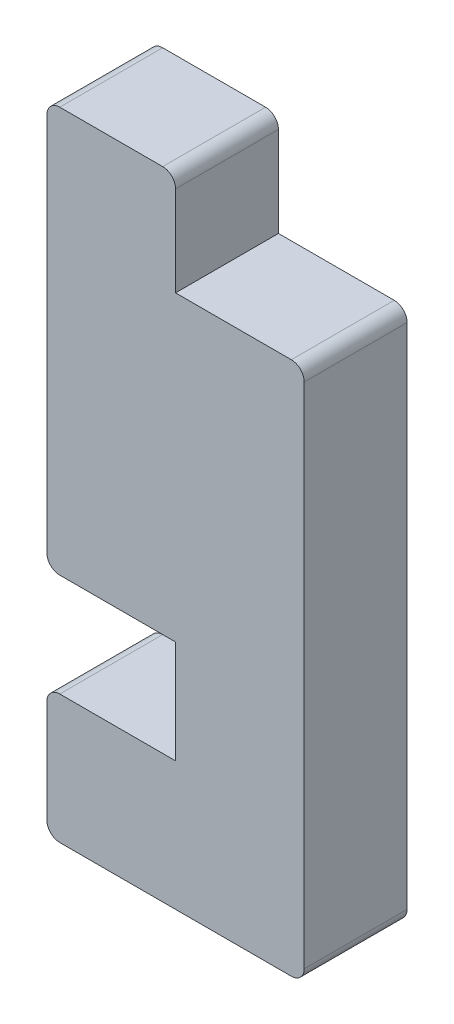
ISO-10303-21;
HEADER;
FILE_DESCRIPTION(('STEP AP214'),'2;1');
FILE_NAME('part.step','',(''),(''),'','','');
FILE_SCHEMA(('AUTOMOTIVE_DESIGN { 1 0 10303 214 1 1 1 1 }'));
ENDSEC;
DATA;
#1=APPLICATION_CONTEXT('core data for automotive mechanical design processes');
#2=APPLICATION_PROTOCOL_DEFINITION('international standard','automotive_design',2000,#1);
#3=PRODUCT_CONTEXT('',#1,'mechanical');
#4=PRODUCT('Part','Part','',(#3));
#5=PRODUCT_RELATED_PRODUCT_CATEGORY('part','',(#4));
#6=PRODUCT_DEFINITION_FORMATION('','',#4);
#7=PRODUCT_DEFINITION_CONTEXT('part definition',#1,'design');
#8=PRODUCT_DEFINITION('design','',#6,#7);
#9=PRODUCT_DEFINITION_SHAPE('','',#8);
#10=(LENGTH_UNIT() NAMED_UNIT(*) SI_UNIT(.MILLI.,.METRE.));
#11=(NAMED_UNIT(*) PLANE_ANGLE_UNIT() SI_UNIT($,.RADIAN.));
#12=(NAMED_UNIT(*) SI_UNIT($,.STERADIAN.) SOLID_ANGLE_UNIT());
#13=UNCERTAINTY_MEASURE_WITH_UNIT(LENGTH_MEASURE(1.E-05),#10,'distance_accuracy_value','');
#14=(GEOMETRIC_REPRESENTATION_CONTEXT(3) GLOBAL_UNCERTAINTY_ASSIGNED_CONTEXT((#13)) GLOBAL_UNIT_ASSIGNED_CONTEXT((#10,
#11,#12)) REPRESENTATION_CONTEXT('',''));
#15=CARTESIAN_POINT('',(0.,0.,0.));
#16=DIRECTION('',(0.,0.,1.));
#17=DIRECTION('',(1.,0.,0.));
#18=AXIS2_PLACEMENT_3D('',#15,#16,#17);
#19=CARTESIAN_POINT('',(10.,18.,8.));
#20=DIRECTION('',(1.,0.,0.));
#21=DIRECTION('',(0.,0.,-1.));
#22=AXIS2_PLACEMENT_3D('',#19,#20,#21);
#23=PLANE('',#22);
#24=DIRECTION('',(0.,-1.,0.));
#25=VECTOR('',#24,1.);
#26=CARTESIAN_POINT('',(10.,18.,0.));
#27=LINE('',#26,#25);
#28=CARTESIAN_POINT('',(10.,18.,0.));
#29=VERTEX_POINT('',#28);
#30=CARTESIAN_POINT('',(10.,10.,0.));
#31=VERTEX_POINT('',#30);
#32=EDGE_CURVE('E185',#29,#31,#27,.T.);
#33=ORIENTED_EDGE('',*,*,#32,.T.);
#34=DIRECTION('',(0.,0.,-1.));
#35=VECTOR('',#34,1.);
#36=CARTESIAN_POINT('',(10.,10.,8.));
#37=LINE('',#36,#35);
#38=CARTESIAN_POINT('',(10.,10.,8.));
#39=VERTEX_POINT('',#38);
#40=EDGE_CURVE('E11',#39,#31,#37,.T.);
#41=ORIENTED_EDGE('',*,*,#40,.F.);
#42=DIRECTION('',(0.,-1.,0.));
#43=VECTOR('',#42,1.);
#44=CARTESIAN_POINT('',(10.,18.,8.));
#45=LINE('',#44,#43);
#46=CARTESIAN_POINT('',(10.,18.,8.));
#47=VERTEX_POINT('',#46);
#48=EDGE_CURVE('E217',#47,#39,#45,.T.);
#49=ORIENTED_EDGE('',*,*,#48,.F.);
#50=DIRECTION('',(0.,0.,-1.));
#51=VECTOR('',#50,1.);
#52=CARTESIAN_POINT('',(10.,18.,8.));
#53=LINE('',#52,#51);
#54=EDGE_CURVE('E181',#47,#29,#53,.T.);
#55=ORIENTED_EDGE('',*,*,#54,.T.);
#56=EDGE_LOOP('',(#33,#41,#49,#55));
#57=FACE_BOUND('',#56,.T.);
#58=ADVANCED_FACE('F35',(#57),#23,.F.);
#59=CARTESIAN_POINT('',(10.,10.,8.));
#60=DIRECTION('',(0.,-1.,0.));
#61=DIRECTION('',(0.,0.,-1.));
#62=AXIS2_PLACEMENT_3D('',#59,#60,#61);
#63=PLANE('',#62);
#64=DIRECTION('',(-1.,0.,0.));
#65=VECTOR('',#64,1.);
#66=CARTESIAN_POINT('',(10.,10.,0.));
#67=LINE('',#66,#65);
#68=CARTESIAN_POINT('',(1.00000000000001,10.,0.));
#69=VERTEX_POINT('',#68);
#70=EDGE_CURVE('E188',#31,#69,#67,.T.);
#71=ORIENTED_EDGE('',*,*,#70,.T.);
#72=DIRECTION('',(0.,0.,-1.));
#73=VECTOR('',#72,1.);
#74=CARTESIAN_POINT('',(1.00000000000001,10.,8.));
#75=LINE('',#74,#73);
#76=CARTESIAN_POINT('',(1.00000000000001,10.,8.));
#77=VERTEX_POINT('',#76);
#78=EDGE_CURVE('E43',#77,#69,#75,.T.);
#79=ORIENTED_EDGE('',*,*,#78,.F.);
#80=DIRECTION('',(-1.,0.,0.));
#81=VECTOR('',#80,1.);
#82=CARTESIAN_POINT('',(10.,10.,8.));
#83=LINE('',#82,#81);
#84=EDGE_CURVE('E121',#39,#77,#83,.T.);
#85=ORIENTED_EDGE('',*,*,#84,.F.);
#86=ORIENTED_EDGE('',*,*,#40,.T.);
#87=EDGE_LOOP('',(#71,#79,#85,#86));
#88=FACE_BOUND('',#87,.T.);
#89=ADVANCED_FACE('F320',(#88),#63,.F.);
#90=CARTESIAN_POINT('',(1.,9.,8.));
#91=DIRECTION('',(0.,0.,-1.));
#92=DIRECTION('',(-1.,0.,0.));
#93=AXIS2_PLACEMENT_3D('',#90,#91,#92);
#94=CYLINDRICAL_SURFACE('',#93,1.);
#95=CARTESIAN_POINT('',(1.,9.,0.));
#96=DIRECTION('',(0.,0.,1.));
#97=DIRECTION('',(1.,0.,0.));
#98=AXIS2_PLACEMENT_3D('',#95,#96,#97);
#99=CIRCLE('',#98,1.);
#100=CARTESIAN_POINT('',(0.,9.,0.));
#101=VERTEX_POINT('',#100);
#102=EDGE_CURVE('E190',#69,#101,#99,.T.);
#103=ORIENTED_EDGE('',*,*,#102,.T.);
#104=DIRECTION('',(0.,0.,-1.));
#105=VECTOR('',#104,1.);
#106=CARTESIAN_POINT('',(0.,9.,8.));
#107=LINE('',#106,#105);
#108=CARTESIAN_POINT('',(0.,9.,8.));
#109=VERTEX_POINT('',#108);
#110=EDGE_CURVE('E251',#109,#101,#107,.T.);
#111=ORIENTED_EDGE('',*,*,#110,.F.);
#112=CARTESIAN_POINT('',(1.,9.,8.));
#113=DIRECTION('',(0.,0.,1.));
#114=DIRECTION('',(1.,0.,0.));
#115=AXIS2_PLACEMENT_3D('',#112,#113,#114);
#116=CIRCLE('',#115,1.);
#117=EDGE_CURVE('E259',#77,#109,#116,.T.);
#118=ORIENTED_EDGE('',*,*,#117,.F.);
#119=ORIENTED_EDGE('',*,*,#78,.T.);
#120=EDGE_LOOP('',(#103,#111,#118,#119));
#121=FACE_BOUND('',#120,.T.);
#122=ADVANCED_FACE('F257',(#121),#94,.T.);
#123=CARTESIAN_POINT('',(0.,9.,8.));
#124=DIRECTION('',(1.,0.,0.));
#125=DIRECTION('',(0.,1.,0.));
#126=AXIS2_PLACEMENT_3D('',#123,#124,#125);
#127=PLANE('',#126);
#128=DIRECTION('',(0.,-1.,0.));
#129=VECTOR('',#128,1.);
#130=CARTESIAN_POINT('',(0.,9.,0.));
#131=LINE('',#130,#129);
#132=CARTESIAN_POINT('',(0.,1.00000000000001,0.));
#133=VERTEX_POINT('',#132);
#134=EDGE_CURVE('E192',#101,#133,#131,.T.);
#135=ORIENTED_EDGE('',*,*,#134,.T.);
#136=DIRECTION('',(0.,0.,-1.));
#137=VECTOR('',#136,1.);
#138=CARTESIAN_POINT('',(0.,1.00000000000001,8.));
#139=LINE('',#138,#137);
#140=CARTESIAN_POINT('',(0.,1.00000000000001,8.));
#141=VERTEX_POINT('',#140);
#142=EDGE_CURVE('E248',#141,#133,#139,.T.);
#143=ORIENTED_EDGE('',*,*,#142,.F.);
#144=DIRECTION('',(0.,-1.,0.));
#145=VECTOR('',#144,1.);
#146=CARTESIAN_POINT('',(0.,9.,8.));
#147=LINE('',#146,#145);
#148=EDGE_CURVE('E277',#109,#141,#147,.T.);
#149=ORIENTED_EDGE('',*,*,#148,.F.);
#150=ORIENTED_EDGE('',*,*,#110,.T.);
#151=EDGE_LOOP('',(#135,#143,#149,#150));
#152=FACE_BOUND('',#151,.T.);
#153=ADVANCED_FACE('F268',(#152),#127,.F.);
#154=CARTESIAN_POINT('',(1.,1.,8.));
#155=DIRECTION('',(0.,0.,-1.));
#156=DIRECTION('',(-1.,0.,0.));
#157=AXIS2_PLACEMENT_3D('',#154,#155,#156);
#158=CYLINDRICAL_SURFACE('',#157,1.);
#159=CARTESIAN_POINT('',(1.,1.,0.));
#160=DIRECTION('',(0.,0.,1.));
#161=DIRECTION('',(1.,0.,0.));
#162=AXIS2_PLACEMENT_3D('',#159,#160,#161);
#163=CIRCLE('',#162,1.);
#164=CARTESIAN_POINT('',(1.00000000000001,0.,0.));
#165=VERTEX_POINT('',#164);
#166=EDGE_CURVE('E194',#133,#165,#163,.T.);
#167=ORIENTED_EDGE('',*,*,#166,.T.);
#168=DIRECTION('',(0.,0.,-1.));
#169=VECTOR('',#168,1.);
#170=CARTESIAN_POINT('',(1.00000000000001,0.,8.));
#171=LINE('',#170,#169);
#172=CARTESIAN_POINT('',(1.00000000000001,0.,8.));
#173=VERTEX_POINT('',#172);
#174=EDGE_CURVE('E245',#173,#165,#171,.T.);
#175=ORIENTED_EDGE('',*,*,#174,.F.);
#176=CARTESIAN_POINT('',(1.,1.,8.));
#177=DIRECTION('',(0.,0.,1.));
#178=DIRECTION('',(1.,0.,0.));
#179=AXIS2_PLACEMENT_3D('',#176,#177,#178);
#180=CIRCLE('',#179,1.);
#181=EDGE_CURVE('E274',#141,#173,#180,.T.);
#182=ORIENTED_EDGE('',*,*,#181,.F.);
#183=ORIENTED_EDGE('',*,*,#142,.T.);
#184=EDGE_LOOP('',(#167,#175,#182,#183));
#185=FACE_BOUND('',#184,.T.);
#186=ADVANCED_FACE('F272',(#185),#158,.T.);
#187=CARTESIAN_POINT('',(1.00000000000001,0.,8.));
#188=DIRECTION('',(0.,1.,0.));
#189=DIRECTION('',(0.,0.,1.));
#190=AXIS2_PLACEMENT_3D('',#187,#188,#189);
#191=PLANE('',#190);
#192=DIRECTION('',(1.,0.,0.));
#193=VECTOR('',#192,1.);
#194=CARTESIAN_POINT('',(1.00000000000001,0.,0.));
#195=LINE('',#194,#193);
#196=CARTESIAN_POINT('',(19.,0.,0.));
#197=VERTEX_POINT('',#196);
#198=EDGE_CURVE('E196',#165,#197,#195,.T.);
#199=ORIENTED_EDGE('',*,*,#198,.T.);
#200=DIRECTION('',(0.,0.,-1.));
#201=VECTOR('',#200,1.);
#202=CARTESIAN_POINT('',(19.,0.,8.));
#203=LINE('',#202,#201);
#204=CARTESIAN_POINT('',(19.,0.,8.));
#205=VERTEX_POINT('',#204);
#206=EDGE_CURVE('E242',#205,#197,#203,.T.);
#207=ORIENTED_EDGE('',*,*,#206,.F.);
#208=DIRECTION('',(1.,0.,0.));
#209=VECTOR('',#208,1.);
#210=CARTESIAN_POINT('',(1.00000000000001,0.,8.));
#211=LINE('',#210,#209);
#212=EDGE_CURVE('E276',#173,#205,#211,.T.);
#213=ORIENTED_EDGE('',*,*,#212,.F.);
#214=ORIENTED_EDGE('',*,*,#174,.T.);
#215=EDGE_LOOP('',(#199,#207,#213,#214));
#216=FACE_BOUND('',#215,.T.);
#217=ADVANCED_FACE('F333',(#216),#191,.F.);
#218=CARTESIAN_POINT('',(19.,1.,8.));
#219=DIRECTION('',(0.,0.,-1.));
#220=DIRECTION('',(-1.,0.,0.));
#221=AXIS2_PLACEMENT_3D('',#218,#219,#220);
#222=CYLINDRICAL_SURFACE('',#221,1.);
#223=CARTESIAN_POINT('',(19.,1.,0.));
#224=DIRECTION('',(0.,0.,1.));
#225=DIRECTION('',(1.,0.,0.));
#226=AXIS2_PLACEMENT_3D('',#223,#224,#225);
#227=CIRCLE('',#226,1.);
#228=CARTESIAN_POINT('',(20.,1.00000000000001,0.));
#229=VERTEX_POINT('',#228);
#230=EDGE_CURVE('E198',#197,#229,#227,.T.);
#231=ORIENTED_EDGE('',*,*,#230,.T.);
#232=DIRECTION('',(0.,0.,-1.));
#233=VECTOR('',#232,1.);
#234=CARTESIAN_POINT('',(20.,1.00000000000001,8.));
#235=LINE('',#234,#233);
#236=CARTESIAN_POINT('',(20.,1.00000000000001,8.));
#237=VERTEX_POINT('',#236);
#238=EDGE_CURVE('E239',#237,#229,#235,.T.);
#239=ORIENTED_EDGE('',*,*,#238,.F.);
#240=CARTESIAN_POINT('',(19.,1.,8.));
#241=DIRECTION('',(0.,0.,1.));
#242=DIRECTION('',(1.,0.,0.));
#243=AXIS2_PLACEMENT_3D('',#240,#241,#242);
#244=CIRCLE('',#243,1.);
#245=EDGE_CURVE('E279',#205,#237,#244,.T.);
#246=ORIENTED_EDGE('',*,*,#245,.F.);
#247=ORIENTED_EDGE('',*,*,#206,.T.);
#248=EDGE_LOOP('',(#231,#239,#246,#247));
#249=FACE_BOUND('',#248,.T.);
#250=ADVANCED_FACE('F336',(#249),#222,.T.);
#251=CARTESIAN_POINT('',(20.,1.00000000000001,8.));
#252=DIRECTION('',(-1.,0.,0.));
#253=DIRECTION('',(0.,-1.,0.));
#254=AXIS2_PLACEMENT_3D('',#251,#252,#253);
#255=PLANE('',#254);
#256=DIRECTION('',(0.,1.,0.));
#257=VECTOR('',#256,1.);
#258=CARTESIAN_POINT('',(20.,1.00000000000001,0.));
#259=LINE('',#258,#257);
#260=CARTESIAN_POINT('',(20.,40.5,0.));
#261=VERTEX_POINT('',#260);
#262=EDGE_CURVE('E200',#229,#261,#259,.T.);
#263=ORIENTED_EDGE('',*,*,#262,.T.);
#264=DIRECTION('',(0.,0.,-1.));
#265=VECTOR('',#264,1.);
#266=CARTESIAN_POINT('',(20.,40.5,8.));
#267=LINE('',#266,#265);
#268=CARTESIAN_POINT('',(20.,40.5,8.));
#269=VERTEX_POINT('',#268);
#270=EDGE_CURVE('E236',#269,#261,#267,.T.);
#271=ORIENTED_EDGE('',*,*,#270,.F.);
#272=DIRECTION('',(0.,1.,0.));
#273=VECTOR('',#272,1.);
#274=CARTESIAN_POINT('',(20.,1.00000000000001,8.));
#275=LINE('',#274,#273);
#276=EDGE_CURVE('E285',#237,#269,#275,.T.);
#277=ORIENTED_EDGE('',*,*,#276,.F.);
#278=ORIENTED_EDGE('',*,*,#238,.T.);
#279=EDGE_LOOP('',(#263,#271,#277,#278));
#280=FACE_BOUND('',#279,.T.);
#281=ADVANCED_FACE('F340',(#280),#255,.F.);
#282=CARTESIAN_POINT('',(19.,40.5,8.));
#283=DIRECTION('',(0.,0.,-1.));
#284=DIRECTION('',(-1.,0.,0.));
#285=AXIS2_PLACEMENT_3D('',#282,#283,#284);
#286=CYLINDRICAL_SURFACE('',#285,1.);
#287=CARTESIAN_POINT('',(19.,40.5,0.));
#288=DIRECTION('',(0.,0.,1.));
#289=DIRECTION('',(1.,0.,0.));
#290=AXIS2_PLACEMENT_3D('',#287,#288,#289);
#291=CIRCLE('',#290,1.);
#292=CARTESIAN_POINT('',(19.,41.5,0.));
#293=VERTEX_POINT('',#292);
#294=EDGE_CURVE('E202',#261,#293,#291,.T.);
#295=ORIENTED_EDGE('',*,*,#294,.T.);
#296=DIRECTION('',(0.,0.,-1.));
#297=VECTOR('',#296,1.);
#298=CARTESIAN_POINT('',(19.,41.5,8.));
#299=LINE('',#298,#297);
#300=CARTESIAN_POINT('',(19.,41.5,8.));
#301=VERTEX_POINT('',#300);
#302=EDGE_CURVE('E233',#301,#293,#299,.T.);
#303=ORIENTED_EDGE('',*,*,#302,.F.);
#304=CARTESIAN_POINT('',(19.,40.5,8.));
#305=DIRECTION('',(0.,0.,1.));
#306=DIRECTION('',(1.,0.,0.));
#307=AXIS2_PLACEMENT_3D('',#304,#305,#306);
#308=CIRCLE('',#307,1.);
#309=EDGE_CURVE('E287',#269,#301,#308,.T.);
#310=ORIENTED_EDGE('',*,*,#309,.F.);
#311=ORIENTED_EDGE('',*,*,#270,.T.);
#312=EDGE_LOOP('',(#295,#303,#310,#311));
#313=FACE_BOUND('',#312,.T.);
#314=ADVANCED_FACE('F344',(#313),#286,.T.);
#315=CARTESIAN_POINT('',(10.,41.5,8.));
#316=DIRECTION('',(0.,-1.,0.));
#317=DIRECTION('',(0.,0.,-1.));
#318=AXIS2_PLACEMENT_3D('',#315,#316,#317);
#319=PLANE('',#318);
#320=DIRECTION('',(-1.,0.,0.));
#321=VECTOR('',#320,1.);
#322=CARTESIAN_POINT('',(10.,41.5,0.));
#323=LINE('',#322,#321);
#324=CARTESIAN_POINT('',(10.,41.5,0.));
#325=VERTEX_POINT('',#324);
#326=EDGE_CURVE('E204',#293,#325,#323,.T.);
#327=ORIENTED_EDGE('',*,*,#326,.T.);
#328=DIRECTION('',(0.,0.,-1.));
#329=VECTOR('',#328,1.);
#330=CARTESIAN_POINT('',(10.,41.5,8.));
#331=LINE('',#330,#329);
#332=CARTESIAN_POINT('',(10.,41.5,8.));
#333=VERTEX_POINT('',#332);
#334=EDGE_CURVE('E230',#333,#325,#331,.T.);
#335=ORIENTED_EDGE('',*,*,#334,.F.);
#336=DIRECTION('',(-1.,0.,0.));
#337=VECTOR('',#336,1.);
#338=CARTESIAN_POINT('',(10.,41.5,8.));
#339=LINE('',#338,#337);
#340=EDGE_CURVE('E289',#301,#333,#339,.T.);
#341=ORIENTED_EDGE('',*,*,#340,.F.);
#342=ORIENTED_EDGE('',*,*,#302,.T.);
#343=EDGE_LOOP('',(#327,#335,#341,#342));
#344=FACE_BOUND('',#343,.T.);
#345=ADVANCED_FACE('F348',(#344),#319,.F.);
#346=CARTESIAN_POINT('',(10.,48.5,8.));
#347=DIRECTION('',(-1.,0.,0.));
#348=DIRECTION('',(0.,-1.,0.));
#349=AXIS2_PLACEMENT_3D('',#346,#347,#348);
#350=PLANE('',#349);
#351=DIRECTION('',(0.,1.,0.));
#352=VECTOR('',#351,1.);
#353=CARTESIAN_POINT('',(10.,48.5,0.));
#354=LINE('',#353,#352);
#355=CARTESIAN_POINT('',(10.,48.5,0.));
#356=VERTEX_POINT('',#355);
#357=EDGE_CURVE('E206',#325,#356,#354,.T.);
#358=ORIENTED_EDGE('',*,*,#357,.T.);
#359=DIRECTION('',(0.,0.,-1.));
#360=VECTOR('',#359,1.);
#361=CARTESIAN_POINT('',(10.,48.5,8.));
#362=LINE('',#361,#360);
#363=CARTESIAN_POINT('',(10.,48.5,8.));
#364=VERTEX_POINT('',#363);
#365=EDGE_CURVE('E227',#364,#356,#362,.T.);
#366=ORIENTED_EDGE('',*,*,#365,.F.);
#367=DIRECTION('',(0.,1.,0.));
#368=VECTOR('',#367,1.);
#369=CARTESIAN_POINT('',(10.,48.5,8.));
#370=LINE('',#369,#368);
#371=EDGE_CURVE('E291',#333,#364,#370,.T.);
#372=ORIENTED_EDGE('',*,*,#371,.F.);
#373=ORIENTED_EDGE('',*,*,#334,.T.);
#374=EDGE_LOOP('',(#358,#366,#372,#373));
#375=FACE_BOUND('',#374,.T.);
#376=ADVANCED_FACE('F352',(#375),#350,.F.);
#377=CARTESIAN_POINT('',(9.,48.5,8.));
#378=DIRECTION('',(0.,0.,-1.));
#379=DIRECTION('',(-1.,0.,0.));
#380=AXIS2_PLACEMENT_3D('',#377,#378,#379);
#381=CYLINDRICAL_SURFACE('',#380,1.);
#382=CARTESIAN_POINT('',(9.,48.5,0.));
#383=DIRECTION('',(0.,0.,1.));
#384=DIRECTION('',(1.,0.,0.));
#385=AXIS2_PLACEMENT_3D('',#382,#383,#384);
#386=CIRCLE('',#385,1.);
#387=CARTESIAN_POINT('',(8.99999999999999,49.5,0.));
#388=VERTEX_POINT('',#387);
#389=EDGE_CURVE('E208',#356,#388,#386,.T.);
#390=ORIENTED_EDGE('',*,*,#389,.T.);
#391=DIRECTION('',(0.,0.,-1.));
#392=VECTOR('',#391,1.);
#393=CARTESIAN_POINT('',(8.99999999999999,49.5,8.));
#394=LINE('',#393,#392);
#395=CARTESIAN_POINT('',(8.99999999999999,49.5,8.));
#396=VERTEX_POINT('',#395);
#397=EDGE_CURVE('E224',#396,#388,#394,.T.);
#398=ORIENTED_EDGE('',*,*,#397,.F.);
#399=CARTESIAN_POINT('',(9.,48.5,8.));
#400=DIRECTION('',(0.,0.,1.));
#401=DIRECTION('',(1.,0.,0.));
#402=AXIS2_PLACEMENT_3D('',#399,#400,#401);
#403=CIRCLE('',#402,1.);
#404=EDGE_CURVE('E293',#364,#396,#403,.T.);
#405=ORIENTED_EDGE('',*,*,#404,.F.);
#406=ORIENTED_EDGE('',*,*,#365,.T.);
#407=EDGE_LOOP('',(#390,#398,#405,#406));
#408=FACE_BOUND('',#407,.T.);
#409=ADVANCED_FACE('F356',(#408),#381,.T.);
#410=CARTESIAN_POINT('',(1.00000000000001,49.5,8.));
#411=DIRECTION('',(0.,-1.,0.));
#412=DIRECTION('',(0.,0.,-1.));
#413=AXIS2_PLACEMENT_3D('',#410,#411,#412);
#414=PLANE('',#413);
#415=DIRECTION('',(-1.,0.,0.));
#416=VECTOR('',#415,1.);
#417=CARTESIAN_POINT('',(1.00000000000001,49.5,0.));
#418=LINE('',#417,#416);
#419=CARTESIAN_POINT('',(1.00000000000001,49.5,0.));
#420=VERTEX_POINT('',#419);
#421=EDGE_CURVE('E210',#388,#420,#418,.T.);
#422=ORIENTED_EDGE('',*,*,#421,.T.);
#423=DIRECTION('',(0.,0.,-1.));
#424=VECTOR('',#423,1.);
#425=CARTESIAN_POINT('',(1.00000000000001,49.5,8.));
#426=LINE('',#425,#424);
#427=CARTESIAN_POINT('',(1.00000000000001,49.5,8.));
#428=VERTEX_POINT('',#427);
#429=EDGE_CURVE('E221',#428,#420,#426,.T.);
#430=ORIENTED_EDGE('',*,*,#429,.F.);
#431=DIRECTION('',(-1.,0.,0.));
#432=VECTOR('',#431,1.);
#433=CARTESIAN_POINT('',(1.00000000000001,49.5,8.));
#434=LINE('',#433,#432);
#435=EDGE_CURVE('E295',#396,#428,#434,.T.);
#436=ORIENTED_EDGE('',*,*,#435,.F.);
#437=ORIENTED_EDGE('',*,*,#397,.T.);
#438=EDGE_LOOP('',(#422,#430,#436,#437));
#439=FACE_BOUND('',#438,.T.);
#440=ADVANCED_FACE('F301',(#439),#414,.F.);
#441=CARTESIAN_POINT('',(1.,48.5,8.));
#442=DIRECTION('',(0.,0.,-1.));
#443=DIRECTION('',(-1.,0.,0.));
#444=AXIS2_PLACEMENT_3D('',#441,#442,#443);
#445=CYLINDRICAL_SURFACE('',#444,1.);
#446=CARTESIAN_POINT('',(1.,48.5,0.));
#447=DIRECTION('',(0.,0.,1.));
#448=DIRECTION('',(-1.,0.,0.));
#449=AXIS2_PLACEMENT_3D('',#446,#447,#448);
#450=CIRCLE('',#449,1.);
#451=CARTESIAN_POINT('',(0.,48.5,0.));
#452=VERTEX_POINT('',#451);
#453=EDGE_CURVE('E212',#420,#452,#450,.T.);
#454=ORIENTED_EDGE('',*,*,#453,.T.);
#455=DIRECTION('',(0.,0.,-1.));
#456=VECTOR('',#455,1.);
#457=CARTESIAN_POINT('',(0.,48.5,8.));
#458=LINE('',#457,#456);
#459=CARTESIAN_POINT('',(0.,48.5,8.));
#460=VERTEX_POINT('',#459);
#461=EDGE_CURVE('E176',#460,#452,#458,.T.);
#462=ORIENTED_EDGE('',*,*,#461,.F.);
#463=CARTESIAN_POINT('',(1.,48.5,8.));
#464=DIRECTION('',(0.,0.,1.));
#465=DIRECTION('',(-1.,0.,0.));
#466=AXIS2_PLACEMENT_3D('',#463,#464,#465);
#467=CIRCLE('',#466,1.);
#468=EDGE_CURVE('E167',#428,#460,#467,.T.);
#469=ORIENTED_EDGE('',*,*,#468,.F.);
#470=ORIENTED_EDGE('',*,*,#429,.T.);
#471=EDGE_LOOP('',(#454,#462,#469,#470));
#472=FACE_BOUND('',#471,.T.);
#473=ADVANCED_FACE('F305',(#472),#445,.T.);
#474=CARTESIAN_POINT('',(0.,48.5,8.));
#475=DIRECTION('',(1.,0.,0.));
#476=DIRECTION('',(0.,1.,0.));
#477=AXIS2_PLACEMENT_3D('',#474,#475,#476);
#478=PLANE('',#477);
#479=DIRECTION('',(0.,-1.,0.));
#480=VECTOR('',#479,1.);
#481=CARTESIAN_POINT('',(0.,48.5,0.));
#482=LINE('',#481,#480);
#483=CARTESIAN_POINT('',(0.,19.,0.));
#484=VERTEX_POINT('',#483);
#485=EDGE_CURVE('E175',#452,#484,#482,.T.);
#486=ORIENTED_EDGE('',*,*,#485,.T.);
#487=DIRECTION('',(0.,0.,-1.));
#488=VECTOR('',#487,1.);
#489=CARTESIAN_POINT('',(0.,19.,8.));
#490=LINE('',#489,#488);
#491=CARTESIAN_POINT('',(0.,19.,8.));
#492=VERTEX_POINT('',#491);
#493=EDGE_CURVE('E172',#492,#484,#490,.T.);
#494=ORIENTED_EDGE('',*,*,#493,.F.);
#495=DIRECTION('',(0.,-1.,0.));
#496=VECTOR('',#495,1.);
#497=CARTESIAN_POINT('',(0.,48.5,8.));
#498=LINE('',#497,#496);
#499=EDGE_CURVE('E161',#460,#492,#498,.T.);
#500=ORIENTED_EDGE('',*,*,#499,.F.);
#501=ORIENTED_EDGE('',*,*,#461,.T.);
#502=EDGE_LOOP('',(#486,#494,#500,#501));
#503=FACE_BOUND('',#502,.T.);
#504=ADVANCED_FACE('F173',(#503),#478,.F.);
#505=CARTESIAN_POINT('',(1.,19.,8.));
#506=DIRECTION('',(0.,0.,-1.));
#507=DIRECTION('',(-1.,0.,0.));
#508=AXIS2_PLACEMENT_3D('',#505,#506,#507);
#509=CYLINDRICAL_SURFACE('',#508,1.);
#510=CARTESIAN_POINT('',(1.,19.,0.));
#511=DIRECTION('',(0.,0.,1.));
#512=DIRECTION('',(-1.,0.,0.));
#513=AXIS2_PLACEMENT_3D('',#510,#511,#512);
#514=CIRCLE('',#513,1.);
#515=CARTESIAN_POINT('',(1.00000000000001,18.,0.));
#516=VERTEX_POINT('',#515);
#517=EDGE_CURVE('E107',#484,#516,#514,.T.);
#518=ORIENTED_EDGE('',*,*,#517,.T.);
#519=DIRECTION('',(0.,0.,-1.));
#520=VECTOR('',#519,1.);
#521=CARTESIAN_POINT('',(1.00000000000001,18.,8.));
#522=LINE('',#521,#520);
#523=CARTESIAN_POINT('',(1.00000000000001,18.,8.));
#524=VERTEX_POINT('',#523);
#525=EDGE_CURVE('E177',#524,#516,#522,.T.);
#526=ORIENTED_EDGE('',*,*,#525,.F.);
#527=CARTESIAN_POINT('',(1.,19.,8.));
#528=DIRECTION('',(0.,0.,1.));
#529=DIRECTION('',(-1.,0.,0.));
#530=AXIS2_PLACEMENT_3D('',#527,#528,#529);
#531=CIRCLE('',#530,1.);
#532=EDGE_CURVE('E165',#492,#524,#531,.T.);
#533=ORIENTED_EDGE('',*,*,#532,.F.);
#534=ORIENTED_EDGE('',*,*,#493,.T.);
#535=EDGE_LOOP('',(#518,#526,#533,#534));
#536=FACE_BOUND('',#535,.T.);
#537=ADVANCED_FACE('F179',(#536),#509,.T.);
#538=CARTESIAN_POINT('',(1.00000000000001,18.,8.));
#539=DIRECTION('',(0.,1.,0.));
#540=DIRECTION('',(0.,0.,1.));
#541=AXIS2_PLACEMENT_3D('',#538,#539,#540);
#542=PLANE('',#541);
#543=DIRECTION('',(1.,0.,0.));
#544=VECTOR('',#543,1.);
#545=CARTESIAN_POINT('',(1.00000000000001,18.,0.));
#546=LINE('',#545,#544);
#547=EDGE_CURVE('E113',#516,#29,#546,.T.);
#548=ORIENTED_EDGE('',*,*,#547,.T.);
#549=ORIENTED_EDGE('',*,*,#54,.F.);
#550=DIRECTION('',(1.,0.,0.));
#551=VECTOR('',#550,1.);
#552=CARTESIAN_POINT('',(1.00000000000001,18.,8.));
#553=LINE('',#552,#551);
#554=EDGE_CURVE('E51',#524,#47,#553,.T.);
#555=ORIENTED_EDGE('',*,*,#554,.F.);
#556=ORIENTED_EDGE('',*,*,#525,.T.);
#557=EDGE_LOOP('',(#548,#549,#555,#556));
#558=FACE_BOUND('',#557,.T.);
#559=ADVANCED_FACE('F309',(#558),#542,.F.);
#560=CARTESIAN_POINT('',(1.,9.,8.));
#561=DIRECTION('',(0.,0.,1.));
#562=DIRECTION('',(1.,0.,0.));
#563=AXIS2_PLACEMENT_3D('',#560,#561,#562);
#564=PLANE('',#563);
#565=ORIENTED_EDGE('',*,*,#48,.T.);
#566=ORIENTED_EDGE('',*,*,#84,.T.);
#567=ORIENTED_EDGE('',*,*,#117,.T.);
#568=ORIENTED_EDGE('',*,*,#148,.T.);
#569=ORIENTED_EDGE('',*,*,#181,.T.);
#570=ORIENTED_EDGE('',*,*,#212,.T.);
#571=ORIENTED_EDGE('',*,*,#245,.T.);
#572=ORIENTED_EDGE('',*,*,#276,.T.);
#573=ORIENTED_EDGE('',*,*,#309,.T.);
#574=ORIENTED_EDGE('',*,*,#340,.T.);
#575=ORIENTED_EDGE('',*,*,#371,.T.);
#576=ORIENTED_EDGE('',*,*,#404,.T.);
#577=ORIENTED_EDGE('',*,*,#435,.T.);
#578=ORIENTED_EDGE('',*,*,#468,.T.);
#579=ORIENTED_EDGE('',*,*,#499,.T.);
#580=ORIENTED_EDGE('',*,*,#532,.T.);
#581=ORIENTED_EDGE('',*,*,#554,.T.);
#582=EDGE_LOOP('',(#565,#566,#567,#568,#569,#570,#571,#572,#573,#574,#575,#576,#577,#578,#579,
#580,#581));
#583=FACE_BOUND('',#582,.T.);
#584=ADVANCED_FACE('F163',(#583),#564,.T.);
#585=CARTESIAN_POINT('',(1.,9.,0.));
#586=DIRECTION('',(0.,0.,1.));
#587=DIRECTION('',(1.,0.,0.));
#588=AXIS2_PLACEMENT_3D('',#585,#586,#587);
#589=PLANE('',#588);
#590=ORIENTED_EDGE('',*,*,#32,.F.);
#591=ORIENTED_EDGE('',*,*,#547,.F.);
#592=ORIENTED_EDGE('',*,*,#517,.F.);
#593=ORIENTED_EDGE('',*,*,#485,.F.);
#594=ORIENTED_EDGE('',*,*,#453,.F.);
#595=ORIENTED_EDGE('',*,*,#421,.F.);
#596=ORIENTED_EDGE('',*,*,#389,.F.);
#597=ORIENTED_EDGE('',*,*,#357,.F.);
#598=ORIENTED_EDGE('',*,*,#326,.F.);
#599=ORIENTED_EDGE('',*,*,#294,.F.);
#600=ORIENTED_EDGE('',*,*,#262,.F.);
#601=ORIENTED_EDGE('',*,*,#230,.F.);
#602=ORIENTED_EDGE('',*,*,#198,.F.);
#603=ORIENTED_EDGE('',*,*,#166,.F.);
#604=ORIENTED_EDGE('',*,*,#134,.F.);
#605=ORIENTED_EDGE('',*,*,#102,.F.);
#606=ORIENTED_EDGE('',*,*,#70,.F.);
#607=EDGE_LOOP('',(#590,#591,#592,#593,#594,#595,#596,#597,#598,#599,#600,#601,#602,#603,#604,
#605,#606));
#608=FACE_BOUND('',#607,.T.);
#609=ADVANCED_FACE('F263',(#608),#589,.F.);
#610=CLOSED_SHELL('',(#58,#89,#122,#153,#186,#217,#250,#281,#314,#345,#376,#409,#440,#473,#504,
#537,#559,#584,#609));
#611=MANIFOLD_SOLID_BREP('B2',#610);
#612=ADVANCED_BREP_SHAPE_REPRESENTATION('',(#18,#611),#14);
#613=SHAPE_DEFINITION_REPRESENTATION(#9,#612);
ENDSEC;
END-ISO-10303-21;
